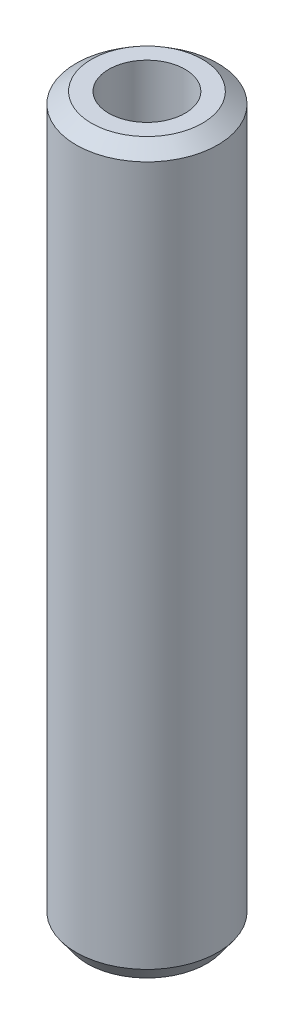
ISO-10303-21;
HEADER;
FILE_DESCRIPTION(('STEP AP214'),'2;1');
FILE_NAME('part.step','',(''),(''),'','','');
FILE_SCHEMA(('AUTOMOTIVE_DESIGN { 1 0 10303 214 1 1 1 1 }'));
ENDSEC;
DATA;
#1=APPLICATION_CONTEXT('core data for automotive mechanical design processes');
#2=APPLICATION_PROTOCOL_DEFINITION('international standard','automotive_design',2000,#1);
#3=PRODUCT_CONTEXT('',#1,'mechanical');
#4=PRODUCT('Part','Part','',(#3));
#5=PRODUCT_RELATED_PRODUCT_CATEGORY('part','',(#4));
#6=PRODUCT_DEFINITION_FORMATION('','',#4);
#7=PRODUCT_DEFINITION_CONTEXT('part definition',#1,'design');
#8=PRODUCT_DEFINITION('design','',#6,#7);
#9=PRODUCT_DEFINITION_SHAPE('','',#8);
#10=(LENGTH_UNIT() NAMED_UNIT(*) SI_UNIT(.MILLI.,.METRE.));
#11=(NAMED_UNIT(*) PLANE_ANGLE_UNIT() SI_UNIT($,.RADIAN.));
#12=(NAMED_UNIT(*) SI_UNIT($,.STERADIAN.) SOLID_ANGLE_UNIT());
#13=UNCERTAINTY_MEASURE_WITH_UNIT(LENGTH_MEASURE(1.E-05),#10,'distance_accuracy_value','');
#14=(GEOMETRIC_REPRESENTATION_CONTEXT(3) GLOBAL_UNCERTAINTY_ASSIGNED_CONTEXT((#13)) GLOBAL_UNIT_ASSIGNED_CONTEXT((#10,
#11,#12)) REPRESENTATION_CONTEXT('',''));
#15=CARTESIAN_POINT('',(0.,0.,0.));
#16=DIRECTION('',(0.,0.,1.));
#17=DIRECTION('',(1.,0.,0.));
#18=AXIS2_PLACEMENT_3D('',#15,#16,#17);
#19=CARTESIAN_POINT('',(0.,153.775560712404,0.));
#20=DIRECTION('',(0.,-1.,0.));
#21=DIRECTION('',(0.,0.,-1.));
#22=AXIS2_PLACEMENT_3D('',#19,#20,#21);
#23=CYLINDRICAL_SURFACE('',#22,15.);
#24=CARTESIAN_POINT('',(0.,151.418960271403,0.));
#25=DIRECTION('',(0.,1.,0.));
#26=DIRECTION('',(0.,0.,1.));
#27=AXIS2_PLACEMENT_3D('',#24,#25,#26);
#28=CIRCLE('',#27,15.);
#29=CARTESIAN_POINT('',(0.,151.418960271403,15.));
#30=VERTEX_POINT('',#29);
#31=EDGE_CURVE('E50',#30,#30,#28,.F.);
#32=ORIENTED_EDGE('',*,*,#31,.T.);
#33=EDGE_LOOP('',(#32));
#34=FACE_BOUND('',#33,.T.);
#35=CARTESIAN_POINT('',(0.,3.24987413403258,0.));
#36=DIRECTION('',(0.,1.,0.));
#37=DIRECTION('',(0.,0.,1.));
#38=AXIS2_PLACEMENT_3D('',#35,#36,#37);
#39=CIRCLE('',#38,15.);
#40=CARTESIAN_POINT('',(0.,3.24987413403258,15.));
#41=VERTEX_POINT('',#40);
#42=EDGE_CURVE('E51',#41,#41,#39,.T.);
#43=ORIENTED_EDGE('',*,*,#42,.T.);
#44=EDGE_LOOP('',(#43));
#45=FACE_BOUND('',#44,.T.);
#46=ADVANCED_FACE('F39',(#34,#45),#23,.T.);
#47=CARTESIAN_POINT('',(0.,153.775560712404,0.));
#48=DIRECTION('',(0.,1.,0.));
#49=DIRECTION('',(0.,0.,1.));
#50=AXIS2_PLACEMENT_3D('',#47,#48,#49);
#51=PLANE('',#50);
#52=CARTESIAN_POINT('',(0.,153.775560712404,0.));
#53=DIRECTION('',(0.,1.,0.));
#54=DIRECTION('',(0.,0.,1.));
#55=AXIS2_PLACEMENT_3D('',#52,#53,#54);
#56=CIRCLE('',#55,11.7501258659674);
#57=CARTESIAN_POINT('',(0.,153.775560712404,11.7501258659674));
#58=VERTEX_POINT('',#57);
#59=EDGE_CURVE('E54',#58,#58,#56,.T.);
#60=ORIENTED_EDGE('',*,*,#59,.T.);
#61=EDGE_LOOP('',(#60));
#62=FACE_BOUND('',#61,.T.);
#63=CARTESIAN_POINT('',(0.,153.775560712404,0.));
#64=DIRECTION('',(0.,1.,0.));
#65=DIRECTION('',(0.,0.,1.));
#66=AXIS2_PLACEMENT_3D('',#63,#64,#65);
#67=CIRCLE('',#66,8.08384334853778);
#68=CARTESIAN_POINT('',(0.,153.775560712404,8.08384334853778));
#69=VERTEX_POINT('',#68);
#70=EDGE_CURVE('E58',#69,#69,#67,.T.);
#71=ORIENTED_EDGE('',*,*,#70,.F.);
#72=EDGE_LOOP('',(#71));
#73=FACE_BOUND('',#72,.T.);
#74=ADVANCED_FACE('F69',(#62,#73),#51,.T.);
#75=CARTESIAN_POINT('',(0.,0.,0.));
#76=DIRECTION('',(0.,1.,0.));
#77=DIRECTION('',(0.,0.,1.));
#78=AXIS2_PLACEMENT_3D('',#75,#76,#77);
#79=PLANE('',#78);
#80=CARTESIAN_POINT('',(0.,0.,0.));
#81=DIRECTION('',(0.,1.,0.));
#82=DIRECTION('',(0.,0.,1.));
#83=AXIS2_PLACEMENT_3D('',#80,#81,#82);
#84=CIRCLE('',#83,12.6433995589989);
#85=CARTESIAN_POINT('',(0.,0.,12.6433995589989));
#86=VERTEX_POINT('',#85);
#87=EDGE_CURVE('E10',#86,#86,#84,.F.);
#88=ORIENTED_EDGE('',*,*,#87,.T.);
#89=EDGE_LOOP('',(#88));
#90=FACE_BOUND('',#89,.T.);
#91=CARTESIAN_POINT('',(0.,0.,0.));
#92=DIRECTION('',(0.,1.,0.));
#93=DIRECTION('',(0.,0.,1.));
#94=AXIS2_PLACEMENT_3D('',#91,#92,#93);
#95=CIRCLE('',#94,8.08384334853778);
#96=CARTESIAN_POINT('',(0.,0.,8.08384334853778));
#97=VERTEX_POINT('',#96);
#98=EDGE_CURVE('E63',#97,#97,#95,.T.);
#99=ORIENTED_EDGE('',*,*,#98,.T.);
#100=EDGE_LOOP('',(#99));
#101=FACE_BOUND('',#100,.T.);
#102=ADVANCED_FACE('F75',(#90,#101),#79,.F.);
#103=CARTESIAN_POINT('',(0.,153.775560712404,0.));
#104=DIRECTION('',(0.,-1.,0.));
#105=DIRECTION('',(0.,0.,-1.));
#106=AXIS2_PLACEMENT_3D('',#103,#104,#105);
#107=CYLINDRICAL_SURFACE('',#106,8.08384334853778);
#108=ORIENTED_EDGE('',*,*,#70,.T.);
#109=EDGE_LOOP('',(#108));
#110=FACE_BOUND('',#109,.T.);
#111=ORIENTED_EDGE('',*,*,#98,.F.);
#112=EDGE_LOOP('',(#111));
#113=FACE_BOUND('',#112,.T.);
#114=ADVANCED_FACE('F70',(#110,#113),#107,.F.);
#115=CARTESIAN_POINT('',(0.,153.775560712404,0.));
#116=DIRECTION('',(0.,-1.,0.));
#117=DIRECTION('',(0.,0.,-1.));
#118=AXIS2_PLACEMENT_3D('',#115,#116,#117);
#119=CONICAL_SURFACE('',#118,11.7501258659674,0.943399054778865);
#120=ORIENTED_EDGE('',*,*,#31,.F.);
#121=EDGE_LOOP('',(#120));
#122=FACE_BOUND('',#121,.T.);
#123=ORIENTED_EDGE('',*,*,#59,.F.);
#124=EDGE_LOOP('',(#123));
#125=FACE_BOUND('',#124,.T.);
#126=ADVANCED_FACE('F81',(#122,#125),#119,.T.);
#127=CARTESIAN_POINT('',(0.,3.24987413403258,0.));
#128=DIRECTION('',(0.,1.,0.));
#129=DIRECTION('',(0.,0.,1.));
#130=AXIS2_PLACEMENT_3D('',#127,#128,#129);
#131=CONICAL_SURFACE('',#130,15.,0.627397272016028);
#132=ORIENTED_EDGE('',*,*,#87,.F.);
#133=EDGE_LOOP('',(#132));
#134=FACE_BOUND('',#133,.T.);
#135=ORIENTED_EDGE('',*,*,#42,.F.);
#136=EDGE_LOOP('',(#135));
#137=FACE_BOUND('',#136,.T.);
#138=ADVANCED_FACE('F45',(#134,#137),#131,.T.);
#139=CLOSED_SHELL('',(#46,#74,#102,#114,#126,#138));
#140=MANIFOLD_SOLID_BREP('B2',#139);
#141=ADVANCED_BREP_SHAPE_REPRESENTATION('',(#18,#140),#14);
#142=SHAPE_DEFINITION_REPRESENTATION(#9,#141);
ENDSEC;
END-ISO-10303-21;
